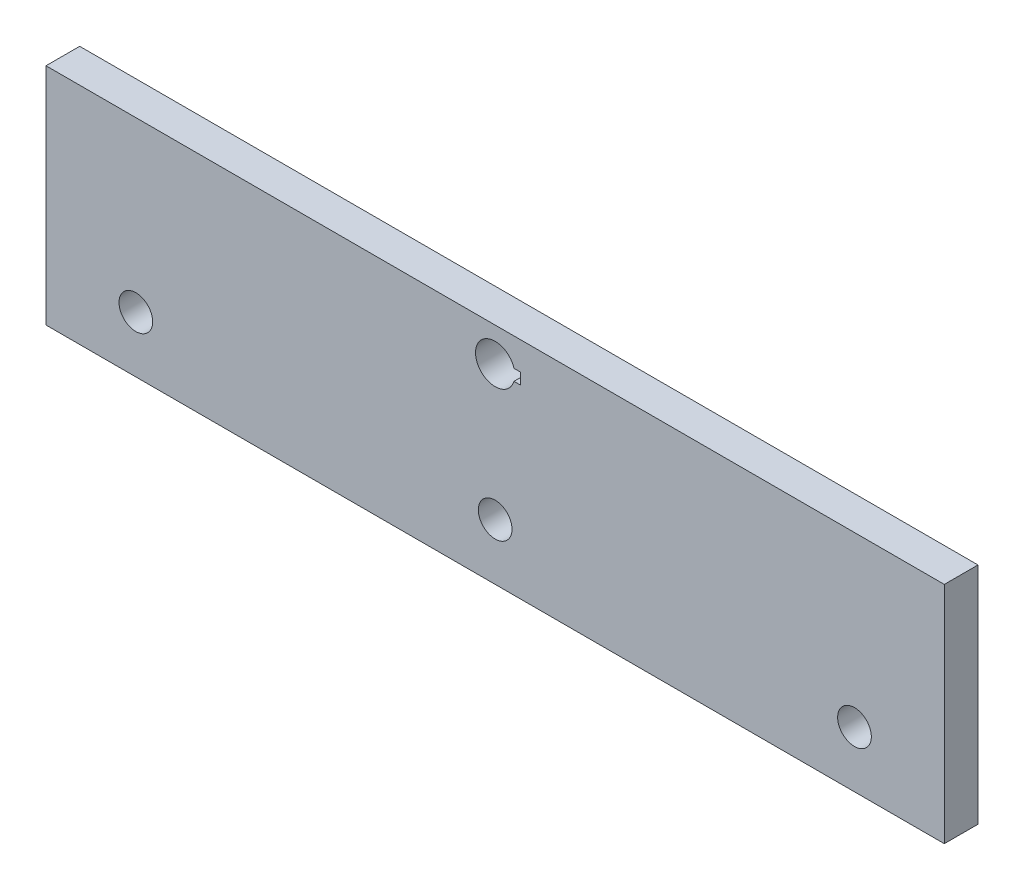
ISO-10303-21;
HEADER;
FILE_DESCRIPTION(('STEP AP214'),'2;1');
FILE_NAME('part.step','',(''),(''),'','','');
FILE_SCHEMA(('AUTOMOTIVE_DESIGN { 1 0 10303 214 1 1 1 1 }'));
ENDSEC;
DATA;
#1=APPLICATION_CONTEXT('core data for automotive mechanical design processes');
#2=APPLICATION_PROTOCOL_DEFINITION('international standard','automotive_design',2000,#1);
#3=PRODUCT_CONTEXT('',#1,'mechanical');
#4=PRODUCT('Part','Part','',(#3));
#5=PRODUCT_RELATED_PRODUCT_CATEGORY('part','',(#4));
#6=PRODUCT_DEFINITION_FORMATION('','',#4);
#7=PRODUCT_DEFINITION_CONTEXT('part definition',#1,'design');
#8=PRODUCT_DEFINITION('design','',#6,#7);
#9=PRODUCT_DEFINITION_SHAPE('','',#8);
#10=(LENGTH_UNIT() NAMED_UNIT(*) SI_UNIT(.MILLI.,.METRE.));
#11=(NAMED_UNIT(*) PLANE_ANGLE_UNIT() SI_UNIT($,.RADIAN.));
#12=(NAMED_UNIT(*) SI_UNIT($,.STERADIAN.) SOLID_ANGLE_UNIT());
#13=UNCERTAINTY_MEASURE_WITH_UNIT(LENGTH_MEASURE(1.E-05),#10,'distance_accuracy_value','');
#14=(GEOMETRIC_REPRESENTATION_CONTEXT(3) GLOBAL_UNCERTAINTY_ASSIGNED_CONTEXT((#13)) GLOBAL_UNIT_ASSIGNED_CONTEXT((#10,
#11,#12)) REPRESENTATION_CONTEXT('',''));
#15=CARTESIAN_POINT('',(0.,0.,0.));
#16=DIRECTION('',(0.,0.,1.));
#17=DIRECTION('',(1.,0.,0.));
#18=AXIS2_PLACEMENT_3D('',#15,#16,#17);
#19=CARTESIAN_POINT('',(0.,0.,3.));
#20=DIRECTION('',(1.,0.,0.));
#21=DIRECTION('',(0.,0.,-1.));
#22=AXIS2_PLACEMENT_3D('',#19,#20,#21);
#23=PLANE('',#22);
#24=DIRECTION('',(0.,-1.,0.));
#25=VECTOR('',#24,1.);
#26=CARTESIAN_POINT('',(0.,0.,0.));
#27=LINE('',#26,#25);
#28=CARTESIAN_POINT('',(0.,20.,0.));
#29=VERTEX_POINT('',#28);
#30=CARTESIAN_POINT('',(0.,0.,0.));
#31=VERTEX_POINT('',#30);
#32=EDGE_CURVE('E152',#29,#31,#27,.T.);
#33=ORIENTED_EDGE('',*,*,#32,.T.);
#34=DIRECTION('',(0.,0.,-1.));
#35=VECTOR('',#34,1.);
#36=CARTESIAN_POINT('',(0.,0.,3.));
#37=LINE('',#36,#35);
#38=CARTESIAN_POINT('',(0.,0.,3.));
#39=VERTEX_POINT('',#38);
#40=EDGE_CURVE('E11',#39,#31,#37,.T.);
#41=ORIENTED_EDGE('',*,*,#40,.F.);
#42=DIRECTION('',(0.,-1.,0.));
#43=VECTOR('',#42,1.);
#44=CARTESIAN_POINT('',(0.,0.,3.));
#45=LINE('',#44,#43);
#46=CARTESIAN_POINT('',(0.,20.,3.));
#47=VERTEX_POINT('',#46);
#48=EDGE_CURVE('E153',#47,#39,#45,.T.);
#49=ORIENTED_EDGE('',*,*,#48,.F.);
#50=DIRECTION('',(0.,0.,-1.));
#51=VECTOR('',#50,1.);
#52=CARTESIAN_POINT('',(0.,20.,3.));
#53=LINE('',#52,#51);
#54=EDGE_CURVE('E163',#47,#29,#53,.T.);
#55=ORIENTED_EDGE('',*,*,#54,.T.);
#56=EDGE_LOOP('',(#33,#41,#49,#55));
#57=FACE_BOUND('',#56,.T.);
#58=ADVANCED_FACE('F34',(#57),#23,.F.);
#59=CARTESIAN_POINT('',(0.,0.,3.));
#60=DIRECTION('',(0.,1.,0.));
#61=DIRECTION('',(0.,0.,1.));
#62=AXIS2_PLACEMENT_3D('',#59,#60,#61);
#63=PLANE('',#62);
#64=DIRECTION('',(1.,0.,0.));
#65=VECTOR('',#64,1.);
#66=CARTESIAN_POINT('',(0.,0.,0.));
#67=LINE('',#66,#65);
#68=CARTESIAN_POINT('',(80.,0.,0.));
#69=VERTEX_POINT('',#68);
#70=EDGE_CURVE('E166',#31,#69,#67,.T.);
#71=ORIENTED_EDGE('',*,*,#70,.T.);
#72=DIRECTION('',(0.,0.,-1.));
#73=VECTOR('',#72,1.);
#74=CARTESIAN_POINT('',(80.,0.,3.));
#75=LINE('',#74,#73);
#76=CARTESIAN_POINT('',(80.,0.,3.));
#77=VERTEX_POINT('',#76);
#78=EDGE_CURVE('E41',#77,#69,#75,.T.);
#79=ORIENTED_EDGE('',*,*,#78,.F.);
#80=DIRECTION('',(1.,0.,0.));
#81=VECTOR('',#80,1.);
#82=CARTESIAN_POINT('',(0.,0.,3.));
#83=LINE('',#82,#81);
#84=EDGE_CURVE('E156',#39,#77,#83,.T.);
#85=ORIENTED_EDGE('',*,*,#84,.F.);
#86=ORIENTED_EDGE('',*,*,#40,.T.);
#87=EDGE_LOOP('',(#71,#79,#85,#86));
#88=FACE_BOUND('',#87,.T.);
#89=ADVANCED_FACE('F195',(#88),#63,.F.);
#90=CARTESIAN_POINT('',(80.,0.,3.));
#91=DIRECTION('',(-1.,0.,0.));
#92=DIRECTION('',(0.,0.,1.));
#93=AXIS2_PLACEMENT_3D('',#90,#91,#92);
#94=PLANE('',#93);
#95=DIRECTION('',(0.,1.,0.));
#96=VECTOR('',#95,1.);
#97=CARTESIAN_POINT('',(80.,0.,0.));
#98=LINE('',#97,#96);
#99=CARTESIAN_POINT('',(80.,20.,0.));
#100=VERTEX_POINT('',#99);
#101=EDGE_CURVE('E168',#69,#100,#98,.T.);
#102=ORIENTED_EDGE('',*,*,#101,.T.);
#103=DIRECTION('',(0.,0.,-1.));
#104=VECTOR('',#103,1.);
#105=CARTESIAN_POINT('',(80.,20.,3.));
#106=LINE('',#105,#104);
#107=CARTESIAN_POINT('',(80.,20.,3.));
#108=VERTEX_POINT('',#107);
#109=EDGE_CURVE('E173',#108,#100,#106,.T.);
#110=ORIENTED_EDGE('',*,*,#109,.F.);
#111=DIRECTION('',(0.,1.,0.));
#112=VECTOR('',#111,1.);
#113=CARTESIAN_POINT('',(80.,0.,3.));
#114=LINE('',#113,#112);
#115=EDGE_CURVE('E159',#77,#108,#114,.T.);
#116=ORIENTED_EDGE('',*,*,#115,.F.);
#117=ORIENTED_EDGE('',*,*,#78,.T.);
#118=EDGE_LOOP('',(#102,#110,#116,#117));
#119=FACE_BOUND('',#118,.T.);
#120=ADVANCED_FACE('F180',(#119),#94,.F.);
#121=CARTESIAN_POINT('',(0.,20.,3.));
#122=DIRECTION('',(0.,-1.,0.));
#123=DIRECTION('',(0.,0.,-1.));
#124=AXIS2_PLACEMENT_3D('',#121,#122,#123);
#125=PLANE('',#124);
#126=DIRECTION('',(-1.,0.,0.));
#127=VECTOR('',#126,1.);
#128=CARTESIAN_POINT('',(0.,20.,0.));
#129=LINE('',#128,#127);
#130=EDGE_CURVE('E157',#100,#29,#129,.T.);
#131=ORIENTED_EDGE('',*,*,#130,.T.);
#132=ORIENTED_EDGE('',*,*,#54,.F.);
#133=DIRECTION('',(-1.,0.,0.));
#134=VECTOR('',#133,1.);
#135=CARTESIAN_POINT('',(0.,20.,3.));
#136=LINE('',#135,#134);
#137=EDGE_CURVE('E161',#108,#47,#136,.T.);
#138=ORIENTED_EDGE('',*,*,#137,.F.);
#139=ORIENTED_EDGE('',*,*,#109,.T.);
#140=EDGE_LOOP('',(#131,#132,#138,#139));
#141=FACE_BOUND('',#140,.T.);
#142=ADVANCED_FACE('F189',(#141),#125,.F.);
#143=CARTESIAN_POINT('',(0.,0.,3.));
#144=DIRECTION('',(0.,0.,-1.));
#145=DIRECTION('',(-1.,0.,0.));
#146=AXIS2_PLACEMENT_3D('',#143,#144,#145);
#147=PLANE('',#146);
#148=DIRECTION('',(1.,0.,0.));
#149=VECTOR('',#148,1.);
#150=CARTESIAN_POINT('',(42.25,17.5,3.));
#151=LINE('',#150,#149);
#152=CARTESIAN_POINT('',(41.6770509831249,17.5,3.));
#153=VERTEX_POINT('',#152);
#154=CARTESIAN_POINT('',(42.25,17.5,3.));
#155=VERTEX_POINT('',#154);
#156=EDGE_CURVE('E106',#153,#155,#151,.T.);
#157=ORIENTED_EDGE('',*,*,#156,.T.);
#158=DIRECTION('',(0.,-1.,0.));
#159=VECTOR('',#158,1.);
#160=CARTESIAN_POINT('',(42.25,16.5,3.));
#161=LINE('',#160,#159);
#162=CARTESIAN_POINT('',(42.25,16.5,3.));
#163=VERTEX_POINT('',#162);
#164=EDGE_CURVE('E100',#155,#163,#161,.T.);
#165=ORIENTED_EDGE('',*,*,#164,.T.);
#166=DIRECTION('',(-1.,0.,0.));
#167=VECTOR('',#166,1.);
#168=CARTESIAN_POINT('',(41.6770509831249,16.5,3.));
#169=LINE('',#168,#167);
#170=CARTESIAN_POINT('',(41.6770509831249,16.5,3.));
#171=VERTEX_POINT('',#170);
#172=EDGE_CURVE('E109',#163,#171,#169,.T.);
#173=ORIENTED_EDGE('',*,*,#172,.T.);
#174=CARTESIAN_POINT('',(40.,17.,3.));
#175=DIRECTION('',(0.,0.,-1.));
#176=DIRECTION('',(-1.,0.,0.));
#177=AXIS2_PLACEMENT_3D('',#174,#175,#176);
#178=CIRCLE('',#177,1.75);
#179=EDGE_CURVE('E48',#171,#153,#178,.T.);
#180=ORIENTED_EDGE('',*,*,#179,.T.);
#181=EDGE_LOOP('',(#157,#165,#173,#180));
#182=FACE_BOUND('',#181,.T.);
#183=CARTESIAN_POINT('',(72.,4.99999999999999,3.));
#184=DIRECTION('',(0.,0.,-1.));
#185=DIRECTION('',(-1.,0.,0.));
#186=AXIS2_PLACEMENT_3D('',#183,#184,#185);
#187=CIRCLE('',#186,1.5);
#188=CARTESIAN_POINT('',(70.5,4.99999999999999,3.));
#189=VERTEX_POINT('',#188);
#190=EDGE_CURVE('E149',#189,#189,#187,.T.);
#191=ORIENTED_EDGE('',*,*,#190,.T.);
#192=EDGE_LOOP('',(#191));
#193=FACE_BOUND('',#192,.T.);
#194=CARTESIAN_POINT('',(40.,4.99999999999999,3.));
#195=DIRECTION('',(0.,0.,-1.));
#196=DIRECTION('',(-1.,0.,0.));
#197=AXIS2_PLACEMENT_3D('',#194,#195,#196);
#198=CIRCLE('',#197,1.5);
#199=CARTESIAN_POINT('',(38.5,4.99999999999999,3.));
#200=VERTEX_POINT('',#199);
#201=EDGE_CURVE('E146',#200,#200,#198,.T.);
#202=ORIENTED_EDGE('',*,*,#201,.T.);
#203=EDGE_LOOP('',(#202));
#204=FACE_BOUND('',#203,.T.);
#205=CARTESIAN_POINT('',(7.99999999999998,4.99999999999999,3.));
#206=DIRECTION('',(0.,0.,-1.));
#207=DIRECTION('',(-1.,0.,0.));
#208=AXIS2_PLACEMENT_3D('',#205,#206,#207);
#209=CIRCLE('',#208,1.5);
#210=CARTESIAN_POINT('',(6.49999999999998,4.99999999999999,3.));
#211=VERTEX_POINT('',#210);
#212=EDGE_CURVE('E138',#211,#211,#209,.T.);
#213=ORIENTED_EDGE('',*,*,#212,.T.);
#214=EDGE_LOOP('',(#213));
#215=FACE_BOUND('',#214,.T.);
#216=ORIENTED_EDGE('',*,*,#48,.T.);
#217=ORIENTED_EDGE('',*,*,#84,.T.);
#218=ORIENTED_EDGE('',*,*,#115,.T.);
#219=ORIENTED_EDGE('',*,*,#137,.T.);
#220=EDGE_LOOP('',(#216,#217,#218,#219));
#221=FACE_BOUND('',#220,.T.);
#222=ADVANCED_FACE('F113',(#182,#193,#204,#215,#221),#147,.F.);
#223=CARTESIAN_POINT('',(0.,0.,0.));
#224=DIRECTION('',(0.,0.,-1.));
#225=DIRECTION('',(-1.,0.,0.));
#226=AXIS2_PLACEMENT_3D('',#223,#224,#225);
#227=PLANE('',#226);
#228=DIRECTION('',(0.,-1.,0.));
#229=VECTOR('',#228,1.);
#230=CARTESIAN_POINT('',(42.25,16.5,0.));
#231=LINE('',#230,#229);
#232=CARTESIAN_POINT('',(42.25,17.5,0.));
#233=VERTEX_POINT('',#232);
#234=CARTESIAN_POINT('',(42.25,16.5,0.));
#235=VERTEX_POINT('',#234);
#236=EDGE_CURVE('E56',#233,#235,#231,.T.);
#237=ORIENTED_EDGE('',*,*,#236,.F.);
#238=DIRECTION('',(1.,0.,0.));
#239=VECTOR('',#238,1.);
#240=CARTESIAN_POINT('',(42.25,17.5,0.));
#241=LINE('',#240,#239);
#242=CARTESIAN_POINT('',(41.6770509831249,17.5,0.));
#243=VERTEX_POINT('',#242);
#244=EDGE_CURVE('E116',#243,#233,#241,.T.);
#245=ORIENTED_EDGE('',*,*,#244,.F.);
#246=CARTESIAN_POINT('',(40.,17.,0.));
#247=DIRECTION('',(0.,0.,-1.));
#248=DIRECTION('',(-1.,0.,0.));
#249=AXIS2_PLACEMENT_3D('',#246,#247,#248);
#250=CIRCLE('',#249,1.75);
#251=CARTESIAN_POINT('',(41.6770509831249,16.5,0.));
#252=VERTEX_POINT('',#251);
#253=EDGE_CURVE('E119',#252,#243,#250,.T.);
#254=ORIENTED_EDGE('',*,*,#253,.F.);
#255=DIRECTION('',(-1.,0.,0.));
#256=VECTOR('',#255,1.);
#257=CARTESIAN_POINT('',(41.6770509831249,16.5,0.));
#258=LINE('',#257,#256);
#259=EDGE_CURVE('E125',#235,#252,#258,.T.);
#260=ORIENTED_EDGE('',*,*,#259,.F.);
#261=EDGE_LOOP('',(#237,#245,#254,#260));
#262=FACE_BOUND('',#261,.T.);
#263=CARTESIAN_POINT('',(72.,4.99999999999999,0.));
#264=DIRECTION('',(0.,0.,-1.));
#265=DIRECTION('',(-1.,0.,0.));
#266=AXIS2_PLACEMENT_3D('',#263,#264,#265);
#267=CIRCLE('',#266,1.5);
#268=CARTESIAN_POINT('',(70.5,4.99999999999999,0.));
#269=VERTEX_POINT('',#268);
#270=EDGE_CURVE('E135',#269,#269,#267,.T.);
#271=ORIENTED_EDGE('',*,*,#270,.F.);
#272=EDGE_LOOP('',(#271));
#273=FACE_BOUND('',#272,.T.);
#274=CARTESIAN_POINT('',(40.,4.99999999999999,0.));
#275=DIRECTION('',(0.,0.,-1.));
#276=DIRECTION('',(-1.,0.,0.));
#277=AXIS2_PLACEMENT_3D('',#274,#275,#276);
#278=CIRCLE('',#277,1.5);
#279=CARTESIAN_POINT('',(38.5,4.99999999999999,0.));
#280=VERTEX_POINT('',#279);
#281=EDGE_CURVE('E139',#280,#280,#278,.T.);
#282=ORIENTED_EDGE('',*,*,#281,.F.);
#283=EDGE_LOOP('',(#282));
#284=FACE_BOUND('',#283,.T.);
#285=CARTESIAN_POINT('',(7.99999999999998,4.99999999999999,0.));
#286=DIRECTION('',(0.,0.,-1.));
#287=DIRECTION('',(-1.,0.,0.));
#288=AXIS2_PLACEMENT_3D('',#285,#286,#287);
#289=CIRCLE('',#288,1.5);
#290=CARTESIAN_POINT('',(6.49999999999998,4.99999999999999,0.));
#291=VERTEX_POINT('',#290);
#292=EDGE_CURVE('E131',#291,#291,#289,.T.);
#293=ORIENTED_EDGE('',*,*,#292,.F.);
#294=EDGE_LOOP('',(#293));
#295=FACE_BOUND('',#294,.T.);
#296=ORIENTED_EDGE('',*,*,#32,.F.);
#297=ORIENTED_EDGE('',*,*,#130,.F.);
#298=ORIENTED_EDGE('',*,*,#101,.F.);
#299=ORIENTED_EDGE('',*,*,#70,.F.);
#300=EDGE_LOOP('',(#296,#297,#298,#299));
#301=FACE_BOUND('',#300,.T.);
#302=ADVANCED_FACE('F186',(#262,#273,#284,#295,#301),#227,.T.);
#303=CARTESIAN_POINT('',(7.99999999999998,4.99999999999999,6.));
#304=DIRECTION('',(0.,0.,-1.));
#305=DIRECTION('',(-1.,0.,0.));
#306=AXIS2_PLACEMENT_3D('',#303,#304,#305);
#307=CYLINDRICAL_SURFACE('',#306,1.5);
#308=ORIENTED_EDGE('',*,*,#292,.T.);
#309=EDGE_LOOP('',(#308));
#310=FACE_BOUND('',#309,.T.);
#311=ORIENTED_EDGE('',*,*,#212,.F.);
#312=EDGE_LOOP('',(#311));
#313=FACE_BOUND('',#312,.T.);
#314=ADVANCED_FACE('F207',(#310,#313),#307,.F.);
#315=CARTESIAN_POINT('',(40.,4.99999999999999,6.));
#316=DIRECTION('',(0.,0.,-1.));
#317=DIRECTION('',(-1.,0.,0.));
#318=AXIS2_PLACEMENT_3D('',#315,#316,#317);
#319=CYLINDRICAL_SURFACE('',#318,1.5);
#320=ORIENTED_EDGE('',*,*,#281,.T.);
#321=EDGE_LOOP('',(#320));
#322=FACE_BOUND('',#321,.T.);
#323=ORIENTED_EDGE('',*,*,#201,.F.);
#324=EDGE_LOOP('',(#323));
#325=FACE_BOUND('',#324,.T.);
#326=ADVANCED_FACE('F213',(#322,#325),#319,.F.);
#327=CARTESIAN_POINT('',(72.,4.99999999999999,6.));
#328=DIRECTION('',(0.,0.,-1.));
#329=DIRECTION('',(-1.,0.,0.));
#330=AXIS2_PLACEMENT_3D('',#327,#328,#329);
#331=CYLINDRICAL_SURFACE('',#330,1.5);
#332=ORIENTED_EDGE('',*,*,#270,.T.);
#333=EDGE_LOOP('',(#332));
#334=FACE_BOUND('',#333,.T.);
#335=ORIENTED_EDGE('',*,*,#190,.F.);
#336=EDGE_LOOP('',(#335));
#337=FACE_BOUND('',#336,.T.);
#338=ADVANCED_FACE('F217',(#334,#337),#331,.F.);
#339=CARTESIAN_POINT('',(42.25,16.5,3.));
#340=DIRECTION('',(1.,0.,0.));
#341=DIRECTION('',(0.,0.,-1.));
#342=AXIS2_PLACEMENT_3D('',#339,#340,#341);
#343=PLANE('',#342);
#344=ORIENTED_EDGE('',*,*,#236,.T.);
#345=DIRECTION('',(0.,0.,-1.));
#346=VECTOR('',#345,1.);
#347=CARTESIAN_POINT('',(42.25,16.5,3.));
#348=LINE('',#347,#346);
#349=EDGE_CURVE('E96',#163,#235,#348,.T.);
#350=ORIENTED_EDGE('',*,*,#349,.F.);
#351=ORIENTED_EDGE('',*,*,#164,.F.);
#352=DIRECTION('',(0.,0.,-1.));
#353=VECTOR('',#352,1.);
#354=CARTESIAN_POINT('',(42.25,17.5,3.));
#355=LINE('',#354,#353);
#356=EDGE_CURVE('E129',#155,#233,#355,.T.);
#357=ORIENTED_EDGE('',*,*,#356,.T.);
#358=EDGE_LOOP('',(#344,#350,#351,#357));
#359=FACE_BOUND('',#358,.T.);
#360=ADVANCED_FACE('F98',(#359),#343,.F.);
#361=CARTESIAN_POINT('',(42.25,17.5,3.));
#362=DIRECTION('',(0.,1.,0.));
#363=DIRECTION('',(0.,0.,1.));
#364=AXIS2_PLACEMENT_3D('',#361,#362,#363);
#365=PLANE('',#364);
#366=ORIENTED_EDGE('',*,*,#244,.T.);
#367=ORIENTED_EDGE('',*,*,#356,.F.);
#368=ORIENTED_EDGE('',*,*,#156,.F.);
#369=DIRECTION('',(0.,0.,-1.));
#370=VECTOR('',#369,1.);
#371=CARTESIAN_POINT('',(41.6770509831249,17.5,3.));
#372=LINE('',#371,#370);
#373=EDGE_CURVE('E132',#153,#243,#372,.T.);
#374=ORIENTED_EDGE('',*,*,#373,.T.);
#375=EDGE_LOOP('',(#366,#367,#368,#374));
#376=FACE_BOUND('',#375,.T.);
#377=ADVANCED_FACE('F224',(#376),#365,.F.);
#378=CARTESIAN_POINT('',(40.,17.,3.));
#379=DIRECTION('',(0.,0.,-1.));
#380=DIRECTION('',(-1.,0.,0.));
#381=AXIS2_PLACEMENT_3D('',#378,#379,#380);
#382=CYLINDRICAL_SURFACE('',#381,1.75);
#383=ORIENTED_EDGE('',*,*,#253,.T.);
#384=ORIENTED_EDGE('',*,*,#373,.F.);
#385=ORIENTED_EDGE('',*,*,#179,.F.);
#386=DIRECTION('',(0.,0.,-1.));
#387=VECTOR('',#386,1.);
#388=CARTESIAN_POINT('',(41.6770509831249,16.5,3.));
#389=LINE('',#388,#387);
#390=EDGE_CURVE('E105',#171,#252,#389,.T.);
#391=ORIENTED_EDGE('',*,*,#390,.T.);
#392=EDGE_LOOP('',(#383,#384,#385,#391));
#393=FACE_BOUND('',#392,.T.);
#394=ADVANCED_FACE('F227',(#393),#382,.F.);
#395=CARTESIAN_POINT('',(41.6770509831249,16.5,3.));
#396=DIRECTION('',(0.,-1.,0.));
#397=DIRECTION('',(0.,0.,-1.));
#398=AXIS2_PLACEMENT_3D('',#395,#396,#397);
#399=PLANE('',#398);
#400=ORIENTED_EDGE('',*,*,#259,.T.);
#401=ORIENTED_EDGE('',*,*,#390,.F.);
#402=ORIENTED_EDGE('',*,*,#172,.F.);
#403=ORIENTED_EDGE('',*,*,#349,.T.);
#404=EDGE_LOOP('',(#400,#401,#402,#403));
#405=FACE_BOUND('',#404,.T.);
#406=ADVANCED_FACE('F110',(#405),#399,.F.);
#407=CLOSED_SHELL('',(#58,#89,#120,#142,#222,#302,#314,#326,#338,#360,#377,#394,#406));
#408=MANIFOLD_SOLID_BREP('B2',#407);
#409=ADVANCED_BREP_SHAPE_REPRESENTATION('',(#18,#408),#14);
#410=SHAPE_DEFINITION_REPRESENTATION(#9,#409);
ENDSEC;
END-ISO-10303-21;
